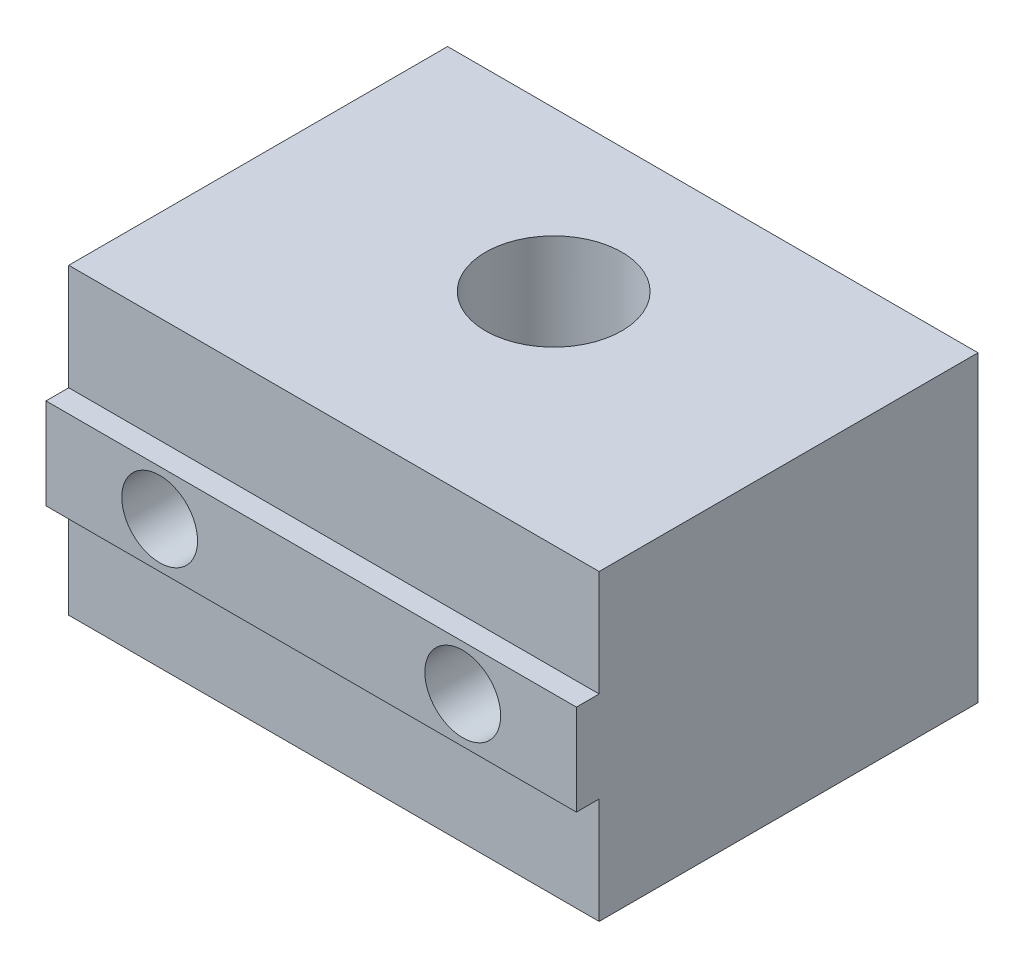
ISO-10303-21;
HEADER;
FILE_DESCRIPTION(('STEP AP214'),'2;1');
FILE_NAME('part.step','',(''),(''),'','','');
FILE_SCHEMA(('AUTOMOTIVE_DESIGN { 1 0 10303 214 1 1 1 1 }'));
ENDSEC;
DATA;
#1=APPLICATION_CONTEXT('core data for automotive mechanical design processes');
#2=APPLICATION_PROTOCOL_DEFINITION('international standard','automotive_design',2000,#1);
#3=PRODUCT_CONTEXT('',#1,'mechanical');
#4=PRODUCT('Part','Part','',(#3));
#5=PRODUCT_RELATED_PRODUCT_CATEGORY('part','',(#4));
#6=PRODUCT_DEFINITION_FORMATION('','',#4);
#7=PRODUCT_DEFINITION_CONTEXT('part definition',#1,'design');
#8=PRODUCT_DEFINITION('design','',#6,#7);
#9=PRODUCT_DEFINITION_SHAPE('','',#8);
#10=(LENGTH_UNIT() NAMED_UNIT(*) SI_UNIT(.MILLI.,.METRE.));
#11=(NAMED_UNIT(*) PLANE_ANGLE_UNIT() SI_UNIT($,.RADIAN.));
#12=(NAMED_UNIT(*) SI_UNIT($,.STERADIAN.) SOLID_ANGLE_UNIT());
#13=UNCERTAINTY_MEASURE_WITH_UNIT(LENGTH_MEASURE(1.E-05),#10,'distance_accuracy_value','');
#14=(GEOMETRIC_REPRESENTATION_CONTEXT(3) GLOBAL_UNCERTAINTY_ASSIGNED_CONTEXT((#13)) GLOBAL_UNIT_ASSIGNED_CONTEXT((#10,
#11,#12)) REPRESENTATION_CONTEXT('',''));
#15=CARTESIAN_POINT('',(0.,0.,0.));
#16=DIRECTION('',(0.,0.,1.));
#17=DIRECTION('',(1.,0.,0.));
#18=AXIS2_PLACEMENT_3D('',#15,#16,#17);
#19=CARTESIAN_POINT('',(27.5,10.,1.500025));
#20=DIRECTION('',(0.,0.,-1.));
#21=DIRECTION('',(-1.,0.,0.));
#22=AXIS2_PLACEMENT_3D('',#19,#20,#21);
#23=CYLINDRICAL_SURFACE('',#22,2.5);
#24=CARTESIAN_POINT('',(27.5,10.,1.5));
#25=DIRECTION('',(0.,0.,1.));
#26=DIRECTION('',(1.,0.,0.));
#27=AXIS2_PLACEMENT_3D('',#24,#25,#26);
#28=CIRCLE('',#27,2.5);
#29=CARTESIAN_POINT('',(30.,10.,1.5));
#30=VERTEX_POINT('',#29);
#31=EDGE_CURVE('E37',#30,#30,#28,.T.);
#32=ORIENTED_EDGE('',*,*,#31,.T.);
#33=EDGE_LOOP('',(#32));
#34=FACE_BOUND('',#33,.T.);
#35=CARTESIAN_POINT('',(27.5,10.,-20.));
#36=DIRECTION('',(0.,0.,-1.));
#37=DIRECTION('',(-1.,0.,0.));
#38=AXIS2_PLACEMENT_3D('',#35,#36,#37);
#39=CIRCLE('',#38,2.5);
#40=CARTESIAN_POINT('',(25.,10.,-20.));
#41=VERTEX_POINT('',#40);
#42=EDGE_CURVE('E194',#41,#41,#39,.F.);
#43=ORIENTED_EDGE('',*,*,#42,.F.);
#44=EDGE_LOOP('',(#43));
#45=FACE_BOUND('',#44,.T.);
#46=ADVANCED_FACE('F33',(#34,#45),#23,.F.);
#47=CARTESIAN_POINT('',(7.5,10.,1.500025));
#48=DIRECTION('',(0.,0.,-1.));
#49=DIRECTION('',(-1.,0.,0.));
#50=AXIS2_PLACEMENT_3D('',#47,#48,#49);
#51=CYLINDRICAL_SURFACE('',#50,2.5);
#52=CARTESIAN_POINT('',(7.5,10.,1.5));
#53=DIRECTION('',(0.,0.,1.));
#54=DIRECTION('',(1.,0.,0.));
#55=AXIS2_PLACEMENT_3D('',#52,#53,#54);
#56=CIRCLE('',#55,2.5);
#57=CARTESIAN_POINT('',(10.,10.,1.5));
#58=VERTEX_POINT('',#57);
#59=EDGE_CURVE('E202',#58,#58,#56,.T.);
#60=ORIENTED_EDGE('',*,*,#59,.T.);
#61=EDGE_LOOP('',(#60));
#62=FACE_BOUND('',#61,.T.);
#63=CARTESIAN_POINT('',(7.5,10.,-20.));
#64=DIRECTION('',(0.,0.,-1.));
#65=DIRECTION('',(-1.,0.,0.));
#66=AXIS2_PLACEMENT_3D('',#63,#64,#65);
#67=CIRCLE('',#66,2.5);
#68=CARTESIAN_POINT('',(5.,10.,-20.));
#69=VERTEX_POINT('',#68);
#70=EDGE_CURVE('E187',#69,#69,#67,.F.);
#71=ORIENTED_EDGE('',*,*,#70,.F.);
#72=EDGE_LOOP('',(#71));
#73=FACE_BOUND('',#72,.T.);
#74=ADVANCED_FACE('F137',(#62,#73),#51,.F.);
#75=CARTESIAN_POINT('',(0.,20.,0.));
#76=DIRECTION('',(0.,0.,-1.));
#77=DIRECTION('',(-1.,0.,0.));
#78=AXIS2_PLACEMENT_3D('',#75,#76,#77);
#79=PLANE('',#78);
#80=DIRECTION('',(1.,0.,0.));
#81=VECTOR('',#80,1.);
#82=CARTESIAN_POINT('',(0.,7.,0.));
#83=LINE('',#82,#81);
#84=CARTESIAN_POINT('',(0.,7.,0.));
#85=VERTEX_POINT('',#84);
#86=CARTESIAN_POINT('',(35.,7.,0.));
#87=VERTEX_POINT('',#86);
#88=EDGE_CURVE('E212',#85,#87,#83,.T.);
#89=ORIENTED_EDGE('',*,*,#88,.F.);
#90=DIRECTION('',(0.,-1.,0.));
#91=VECTOR('',#90,1.);
#92=CARTESIAN_POINT('',(0.,20.,0.));
#93=LINE('',#92,#91);
#94=CARTESIAN_POINT('',(0.,0.,0.));
#95=VERTEX_POINT('',#94);
#96=EDGE_CURVE('E42',#85,#95,#93,.T.);
#97=ORIENTED_EDGE('',*,*,#96,.T.);
#98=DIRECTION('',(1.,0.,0.));
#99=VECTOR('',#98,1.);
#100=CARTESIAN_POINT('',(0.,0.,0.));
#101=LINE('',#100,#99);
#102=CARTESIAN_POINT('',(35.,0.,0.));
#103=VERTEX_POINT('',#102);
#104=EDGE_CURVE('E377',#95,#103,#101,.T.);
#105=ORIENTED_EDGE('',*,*,#104,.T.);
#106=DIRECTION('',(0.,-1.,0.));
#107=VECTOR('',#106,1.);
#108=CARTESIAN_POINT('',(35.,20.,0.));
#109=LINE('',#108,#107);
#110=EDGE_CURVE('E386',#87,#103,#109,.T.);
#111=ORIENTED_EDGE('',*,*,#110,.F.);
#112=EDGE_LOOP('',(#89,#97,#105,#111));
#113=FACE_BOUND('',#112,.T.);
#114=ADVANCED_FACE('F128',(#113),#79,.F.);
#115=CARTESIAN_POINT('',(0.,20.,0.));
#116=DIRECTION('',(1.,0.,0.));
#117=DIRECTION('',(0.,0.,-1.));
#118=AXIS2_PLACEMENT_3D('',#115,#116,#117);
#119=PLANE('',#118);
#120=DIRECTION('',(0.,0.,1.));
#121=VECTOR('',#120,1.);
#122=CARTESIAN_POINT('',(0.,0.,0.));
#123=LINE('',#122,#121);
#124=CARTESIAN_POINT('',(0.,0.,-25.));
#125=VERTEX_POINT('',#124);
#126=EDGE_CURVE('E215',#125,#95,#123,.T.);
#127=ORIENTED_EDGE('',*,*,#126,.T.);
#128=ORIENTED_EDGE('',*,*,#96,.F.);
#129=DIRECTION('',(0.,0.,-1.));
#130=VECTOR('',#129,1.);
#131=CARTESIAN_POINT('',(0.,7.,0.));
#132=LINE('',#131,#130);
#133=CARTESIAN_POINT('',(0.,7.,1.5));
#134=VERTEX_POINT('',#133);
#135=EDGE_CURVE('E113',#134,#85,#132,.T.);
#136=ORIENTED_EDGE('',*,*,#135,.F.);
#137=DIRECTION('',(0.,-1.,0.));
#138=VECTOR('',#137,1.);
#139=CARTESIAN_POINT('',(0.,13.,1.5));
#140=LINE('',#139,#138);
#141=CARTESIAN_POINT('',(0.,13.,1.5));
#142=VERTEX_POINT('',#141);
#143=EDGE_CURVE('E122',#142,#134,#140,.T.);
#144=ORIENTED_EDGE('',*,*,#143,.F.);
#145=DIRECTION('',(0.,0.,1.));
#146=VECTOR('',#145,1.);
#147=CARTESIAN_POINT('',(0.,13.,0.));
#148=LINE('',#147,#146);
#149=CARTESIAN_POINT('',(0.,13.,0.));
#150=VERTEX_POINT('',#149);
#151=EDGE_CURVE('E110',#150,#142,#148,.T.);
#152=ORIENTED_EDGE('',*,*,#151,.F.);
#153=CARTESIAN_POINT('',(0.,20.,0.));
#154=VERTEX_POINT('',#153);
#155=EDGE_CURVE('E11',#154,#150,#93,.T.);
#156=ORIENTED_EDGE('',*,*,#155,.F.);
#157=DIRECTION('',(0.,0.,1.));
#158=VECTOR('',#157,1.);
#159=CARTESIAN_POINT('',(0.,20.,0.));
#160=LINE('',#159,#158);
#161=CARTESIAN_POINT('',(0.,20.,-25.));
#162=VERTEX_POINT('',#161);
#163=EDGE_CURVE('E369',#162,#154,#160,.T.);
#164=ORIENTED_EDGE('',*,*,#163,.F.);
#165=DIRECTION('',(0.,-1.,0.));
#166=VECTOR('',#165,1.);
#167=CARTESIAN_POINT('',(0.,20.,-25.));
#168=LINE('',#167,#166);
#169=EDGE_CURVE('E375',#162,#125,#168,.T.);
#170=ORIENTED_EDGE('',*,*,#169,.T.);
#171=EDGE_LOOP('',(#127,#128,#136,#144,#152,#156,#164,#170));
#172=FACE_BOUND('',#171,.T.);
#173=ADVANCED_FACE('F35',(#172),#119,.F.);
#174=ORIENTED_EDGE('',*,*,#155,.T.);
#175=DIRECTION('',(1.,0.,0.));
#176=VECTOR('',#175,1.);
#177=CARTESIAN_POINT('',(0.,13.,0.));
#178=LINE('',#177,#176);
#179=CARTESIAN_POINT('',(35.,13.,0.));
#180=VERTEX_POINT('',#179);
#181=EDGE_CURVE('E107',#150,#180,#178,.T.);
#182=ORIENTED_EDGE('',*,*,#181,.T.);
#183=CARTESIAN_POINT('',(35.,20.,0.));
#184=VERTEX_POINT('',#183);
#185=EDGE_CURVE('E360',#184,#180,#109,.T.);
#186=ORIENTED_EDGE('',*,*,#185,.F.);
#187=DIRECTION('',(1.,0.,0.));
#188=VECTOR('',#187,1.);
#189=CARTESIAN_POINT('',(0.,20.,0.));
#190=LINE('',#189,#188);
#191=EDGE_CURVE('E87',#154,#184,#190,.T.);
#192=ORIENTED_EDGE('',*,*,#191,.F.);
#193=EDGE_LOOP('',(#174,#182,#186,#192));
#194=FACE_BOUND('',#193,.T.);
#195=ADVANCED_FACE('F125',(#194),#79,.F.);
#196=CARTESIAN_POINT('',(35.,20.,0.));
#197=DIRECTION('',(-1.,0.,0.));
#198=DIRECTION('',(0.,0.,1.));
#199=AXIS2_PLACEMENT_3D('',#196,#197,#198);
#200=PLANE('',#199);
#201=DIRECTION('',(0.,0.,-1.));
#202=VECTOR('',#201,1.);
#203=CARTESIAN_POINT('',(35.,0.,0.));
#204=LINE('',#203,#202);
#205=CARTESIAN_POINT('',(35.,0.,-25.));
#206=VERTEX_POINT('',#205);
#207=EDGE_CURVE('E380',#103,#206,#204,.T.);
#208=ORIENTED_EDGE('',*,*,#207,.T.);
#209=DIRECTION('',(0.,-1.,0.));
#210=VECTOR('',#209,1.);
#211=CARTESIAN_POINT('',(35.,20.,-25.));
#212=LINE('',#211,#210);
#213=CARTESIAN_POINT('',(35.,20.,-25.));
#214=VERTEX_POINT('',#213);
#215=EDGE_CURVE('E384',#214,#206,#212,.T.);
#216=ORIENTED_EDGE('',*,*,#215,.F.);
#217=DIRECTION('',(0.,0.,-1.));
#218=VECTOR('',#217,1.);
#219=CARTESIAN_POINT('',(35.,20.,0.));
#220=LINE('',#219,#218);
#221=EDGE_CURVE('E372',#184,#214,#220,.T.);
#222=ORIENTED_EDGE('',*,*,#221,.F.);
#223=ORIENTED_EDGE('',*,*,#185,.T.);
#224=DIRECTION('',(0.,0.,1.));
#225=VECTOR('',#224,1.);
#226=CARTESIAN_POINT('',(35.,13.,0.));
#227=LINE('',#226,#225);
#228=CARTESIAN_POINT('',(35.,13.,1.5));
#229=VERTEX_POINT('',#228);
#230=EDGE_CURVE('E50',#180,#229,#227,.T.);
#231=ORIENTED_EDGE('',*,*,#230,.T.);
#232=DIRECTION('',(0.,-1.,0.));
#233=VECTOR('',#232,1.);
#234=CARTESIAN_POINT('',(35.,13.,1.5));
#235=LINE('',#234,#233);
#236=CARTESIAN_POINT('',(35.,7.,1.5));
#237=VERTEX_POINT('',#236);
#238=EDGE_CURVE('E204',#229,#237,#235,.T.);
#239=ORIENTED_EDGE('',*,*,#238,.T.);
#240=DIRECTION('',(0.,0.,-1.));
#241=VECTOR('',#240,1.);
#242=CARTESIAN_POINT('',(35.,7.,0.));
#243=LINE('',#242,#241);
#244=EDGE_CURVE('E123',#237,#87,#243,.T.);
#245=ORIENTED_EDGE('',*,*,#244,.T.);
#246=ORIENTED_EDGE('',*,*,#110,.T.);
#247=EDGE_LOOP('',(#208,#216,#222,#223,#231,#239,#245,#246));
#248=FACE_BOUND('',#247,.T.);
#249=ADVANCED_FACE('F127',(#248),#200,.F.);
#250=CARTESIAN_POINT('',(0.,20.,-25.));
#251=DIRECTION('',(0.,0.,1.));
#252=DIRECTION('',(1.,0.,0.));
#253=AXIS2_PLACEMENT_3D('',#250,#251,#252);
#254=PLANE('',#253);
#255=CARTESIAN_POINT('',(27.5,10.,-25.));
#256=DIRECTION('',(0.,0.,-1.));
#257=DIRECTION('',(-1.,0.,0.));
#258=AXIS2_PLACEMENT_3D('',#255,#256,#257);
#259=CIRCLE('',#258,5.);
#260=CARTESIAN_POINT('',(22.5,10.,-25.));
#261=VERTEX_POINT('',#260);
#262=EDGE_CURVE('E182',#261,#261,#259,.T.);
#263=ORIENTED_EDGE('',*,*,#262,.F.);
#264=EDGE_LOOP('',(#263));
#265=FACE_BOUND('',#264,.T.);
#266=CARTESIAN_POINT('',(7.5,10.,-25.));
#267=DIRECTION('',(0.,0.,-1.));
#268=DIRECTION('',(-1.,0.,0.));
#269=AXIS2_PLACEMENT_3D('',#266,#267,#268);
#270=CIRCLE('',#269,5.);
#271=CARTESIAN_POINT('',(2.5,10.,-25.));
#272=VERTEX_POINT('',#271);
#273=EDGE_CURVE('E185',#272,#272,#270,.T.);
#274=ORIENTED_EDGE('',*,*,#273,.F.);
#275=EDGE_LOOP('',(#274));
#276=FACE_BOUND('',#275,.T.);
#277=DIRECTION('',(-1.,0.,0.));
#278=VECTOR('',#277,1.);
#279=CARTESIAN_POINT('',(0.,0.,-25.));
#280=LINE('',#279,#278);
#281=EDGE_CURVE('E80',#206,#125,#280,.T.);
#282=ORIENTED_EDGE('',*,*,#281,.T.);
#283=ORIENTED_EDGE('',*,*,#169,.F.);
#284=DIRECTION('',(-1.,0.,0.));
#285=VECTOR('',#284,1.);
#286=CARTESIAN_POINT('',(0.,20.,-25.));
#287=LINE('',#286,#285);
#288=EDGE_CURVE('E59',#214,#162,#287,.T.);
#289=ORIENTED_EDGE('',*,*,#288,.F.);
#290=ORIENTED_EDGE('',*,*,#215,.T.);
#291=EDGE_LOOP('',(#282,#283,#289,#290));
#292=FACE_BOUND('',#291,.T.);
#293=ADVANCED_FACE('F133',(#265,#276,#292),#254,.F.);
#294=CARTESIAN_POINT('',(0.,20.,0.));
#295=DIRECTION('',(0.,-1.,0.));
#296=DIRECTION('',(0.,0.,-1.));
#297=AXIS2_PLACEMENT_3D('',#294,#295,#296);
#298=PLANE('',#297);
#299=CARTESIAN_POINT('',(17.5,20.,-14.5));
#300=DIRECTION('',(0.,1.,0.));
#301=DIRECTION('',(0.,0.,1.));
#302=AXIS2_PLACEMENT_3D('',#299,#300,#301);
#303=CIRCLE('',#302,4.5);
#304=CARTESIAN_POINT('',(17.5,20.,-9.99999999999999));
#305=VERTEX_POINT('',#304);
#306=EDGE_CURVE('E198',#305,#305,#303,.T.);
#307=ORIENTED_EDGE('',*,*,#306,.F.);
#308=EDGE_LOOP('',(#307));
#309=FACE_BOUND('',#308,.T.);
#310=ORIENTED_EDGE('',*,*,#163,.T.);
#311=ORIENTED_EDGE('',*,*,#191,.T.);
#312=ORIENTED_EDGE('',*,*,#221,.T.);
#313=ORIENTED_EDGE('',*,*,#288,.T.);
#314=EDGE_LOOP('',(#310,#311,#312,#313));
#315=FACE_BOUND('',#314,.T.);
#316=ADVANCED_FACE('F168',(#309,#315),#298,.F.);
#317=CARTESIAN_POINT('',(0.,0.,0.));
#318=DIRECTION('',(0.,-1.,0.));
#319=DIRECTION('',(0.,0.,-1.));
#320=AXIS2_PLACEMENT_3D('',#317,#318,#319);
#321=PLANE('',#320);
#322=CARTESIAN_POINT('',(17.5,0.,-14.5));
#323=DIRECTION('',(0.,-1.,0.));
#324=DIRECTION('',(0.,0.,-1.));
#325=AXIS2_PLACEMENT_3D('',#322,#323,#324);
#326=CIRCLE('',#325,4.5);
#327=CARTESIAN_POINT('',(17.5,0.,-19.));
#328=VERTEX_POINT('',#327);
#329=EDGE_CURVE('E201',#328,#328,#326,.T.);
#330=ORIENTED_EDGE('',*,*,#329,.F.);
#331=EDGE_LOOP('',(#330));
#332=FACE_BOUND('',#331,.T.);
#333=ORIENTED_EDGE('',*,*,#126,.F.);
#334=ORIENTED_EDGE('',*,*,#281,.F.);
#335=ORIENTED_EDGE('',*,*,#207,.F.);
#336=ORIENTED_EDGE('',*,*,#104,.F.);
#337=EDGE_LOOP('',(#333,#334,#335,#336));
#338=FACE_BOUND('',#337,.T.);
#339=ADVANCED_FACE('F161',(#332,#338),#321,.T.);
#340=CARTESIAN_POINT('',(0.,7.,0.));
#341=DIRECTION('',(0.,-1.,0.));
#342=DIRECTION('',(0.,0.,-1.));
#343=AXIS2_PLACEMENT_3D('',#340,#341,#342);
#344=PLANE('',#343);
#345=ORIENTED_EDGE('',*,*,#244,.F.);
#346=DIRECTION('',(1.,0.,0.));
#347=VECTOR('',#346,1.);
#348=CARTESIAN_POINT('',(0.,7.,1.5));
#349=LINE('',#348,#347);
#350=EDGE_CURVE('E209',#134,#237,#349,.T.);
#351=ORIENTED_EDGE('',*,*,#350,.F.);
#352=ORIENTED_EDGE('',*,*,#135,.T.);
#353=ORIENTED_EDGE('',*,*,#88,.T.);
#354=EDGE_LOOP('',(#345,#351,#352,#353));
#355=FACE_BOUND('',#354,.T.);
#356=ADVANCED_FACE('F157',(#355),#344,.T.);
#357=CARTESIAN_POINT('',(0.,13.,1.5));
#358=DIRECTION('',(0.,0.,1.));
#359=DIRECTION('',(1.,0.,0.));
#360=AXIS2_PLACEMENT_3D('',#357,#358,#359);
#361=PLANE('',#360);
#362=ORIENTED_EDGE('',*,*,#31,.F.);
#363=EDGE_LOOP('',(#362));
#364=FACE_BOUND('',#363,.T.);
#365=ORIENTED_EDGE('',*,*,#59,.F.);
#366=EDGE_LOOP('',(#365));
#367=FACE_BOUND('',#366,.T.);
#368=ORIENTED_EDGE('',*,*,#238,.F.);
#369=DIRECTION('',(1.,0.,0.));
#370=VECTOR('',#369,1.);
#371=CARTESIAN_POINT('',(0.,13.,1.5));
#372=LINE('',#371,#370);
#373=EDGE_CURVE('E112',#142,#229,#372,.T.);
#374=ORIENTED_EDGE('',*,*,#373,.F.);
#375=ORIENTED_EDGE('',*,*,#143,.T.);
#376=ORIENTED_EDGE('',*,*,#350,.T.);
#377=EDGE_LOOP('',(#368,#374,#375,#376));
#378=FACE_BOUND('',#377,.T.);
#379=ADVANCED_FACE('F160',(#364,#367,#378),#361,.T.);
#380=CARTESIAN_POINT('',(0.,13.,0.));
#381=DIRECTION('',(0.,1.,0.));
#382=DIRECTION('',(0.,0.,1.));
#383=AXIS2_PLACEMENT_3D('',#380,#381,#382);
#384=PLANE('',#383);
#385=ORIENTED_EDGE('',*,*,#230,.F.);
#386=ORIENTED_EDGE('',*,*,#181,.F.);
#387=ORIENTED_EDGE('',*,*,#151,.T.);
#388=ORIENTED_EDGE('',*,*,#373,.T.);
#389=EDGE_LOOP('',(#385,#386,#387,#388));
#390=FACE_BOUND('',#389,.T.);
#391=ADVANCED_FACE('F109',(#390),#384,.T.);
#392=CARTESIAN_POINT('',(17.5,-2.50000000007189E-05,-14.5));
#393=DIRECTION('',(0.,1.,0.));
#394=DIRECTION('',(0.,0.,1.));
#395=AXIS2_PLACEMENT_3D('',#392,#393,#394);
#396=CYLINDRICAL_SURFACE('',#395,4.5);
#397=ORIENTED_EDGE('',*,*,#329,.T.);
#398=EDGE_LOOP('',(#397));
#399=FACE_BOUND('',#398,.T.);
#400=ORIENTED_EDGE('',*,*,#306,.T.);
#401=EDGE_LOOP('',(#400));
#402=FACE_BOUND('',#401,.T.);
#403=ADVANCED_FACE('F153',(#399,#402),#396,.F.);
#404=CARTESIAN_POINT('',(7.5,10.,-20.));
#405=DIRECTION('',(0.,0.,-1.));
#406=DIRECTION('',(-1.,0.,0.));
#407=AXIS2_PLACEMENT_3D('',#404,#405,#406);
#408=CYLINDRICAL_SURFACE('',#407,5.);
#409=CARTESIAN_POINT('',(7.5,10.,-20.));
#410=DIRECTION('',(0.,0.,-1.));
#411=DIRECTION('',(-1.,0.,0.));
#412=AXIS2_PLACEMENT_3D('',#409,#410,#411);
#413=CIRCLE('',#412,5.);
#414=CARTESIAN_POINT('',(2.5,10.,-20.));
#415=VERTEX_POINT('',#414);
#416=EDGE_CURVE('E191',#415,#415,#413,.T.);
#417=ORIENTED_EDGE('',*,*,#416,.F.);
#418=EDGE_LOOP('',(#417));
#419=FACE_BOUND('',#418,.T.);
#420=ORIENTED_EDGE('',*,*,#273,.T.);
#421=EDGE_LOOP('',(#420));
#422=FACE_BOUND('',#421,.T.);
#423=ADVANCED_FACE('F150',(#419,#422),#408,.F.);
#424=CARTESIAN_POINT('',(0.,0.,-20.));
#425=DIRECTION('',(0.,0.,-1.));
#426=DIRECTION('',(-1.,0.,0.));
#427=AXIS2_PLACEMENT_3D('',#424,#425,#426);
#428=PLANE('',#427);
#429=ORIENTED_EDGE('',*,*,#70,.T.);
#430=EDGE_LOOP('',(#429));
#431=FACE_BOUND('',#430,.T.);
#432=ORIENTED_EDGE('',*,*,#416,.T.);
#433=EDGE_LOOP('',(#432));
#434=FACE_BOUND('',#433,.T.);
#435=ADVANCED_FACE('F231',(#431,#434),#428,.T.);
#436=CARTESIAN_POINT('',(27.5,10.,-20.));
#437=DIRECTION('',(0.,0.,-1.));
#438=DIRECTION('',(-1.,0.,0.));
#439=AXIS2_PLACEMENT_3D('',#436,#437,#438);
#440=CYLINDRICAL_SURFACE('',#439,5.);
#441=CARTESIAN_POINT('',(27.5,10.,-20.));
#442=DIRECTION('',(0.,0.,-1.));
#443=DIRECTION('',(-1.,0.,0.));
#444=AXIS2_PLACEMENT_3D('',#441,#442,#443);
#445=CIRCLE('',#444,5.);
#446=CARTESIAN_POINT('',(22.5,10.,-20.));
#447=VERTEX_POINT('',#446);
#448=EDGE_CURVE('E188',#447,#447,#445,.T.);
#449=ORIENTED_EDGE('',*,*,#448,.F.);
#450=EDGE_LOOP('',(#449));
#451=FACE_BOUND('',#450,.T.);
#452=ORIENTED_EDGE('',*,*,#262,.T.);
#453=EDGE_LOOP('',(#452));
#454=FACE_BOUND('',#453,.T.);
#455=ADVANCED_FACE('F237',(#451,#454),#440,.F.);
#456=CARTESIAN_POINT('',(0.,0.,-20.));
#457=DIRECTION('',(0.,0.,-1.));
#458=DIRECTION('',(-1.,0.,0.));
#459=AXIS2_PLACEMENT_3D('',#456,#457,#458);
#460=PLANE('',#459);
#461=ORIENTED_EDGE('',*,*,#42,.T.);
#462=EDGE_LOOP('',(#461));
#463=FACE_BOUND('',#462,.T.);
#464=ORIENTED_EDGE('',*,*,#448,.T.);
#465=EDGE_LOOP('',(#464));
#466=FACE_BOUND('',#465,.T.);
#467=ADVANCED_FACE('F242',(#463,#466),#460,.T.);
#468=CLOSED_SHELL('',(#46,#74,#114,#173,#195,#249,#293,#316,#339,#356,#379,#391,#403,#423,#435,
#455,#467));
#469=MANIFOLD_SOLID_BREP('B2',#468);
#470=ADVANCED_BREP_SHAPE_REPRESENTATION('',(#18,#469),#14);
#471=SHAPE_DEFINITION_REPRESENTATION(#9,#470);
ENDSEC;
END-ISO-10303-21;
